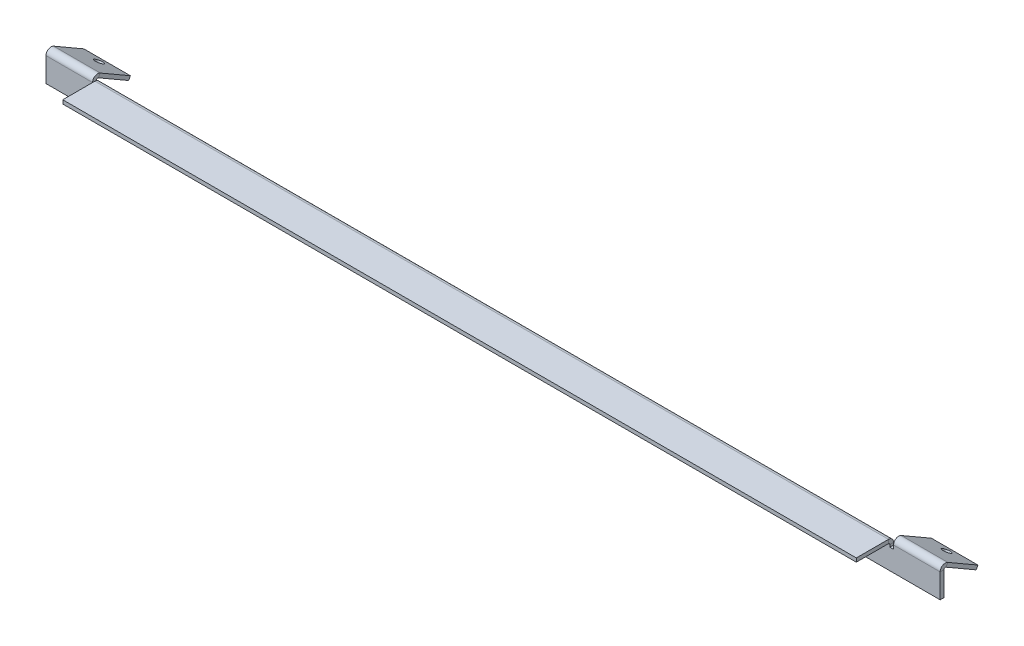
ISO-10303-21;
HEADER;
FILE_DESCRIPTION(('STEP AP214'),'2;1');
FILE_NAME('part.step','',(''),(''),'','','');
FILE_SCHEMA(('AUTOMOTIVE_DESIGN { 1 0 10303 214 1 1 1 1 }'));
ENDSEC;
DATA;
#1=APPLICATION_CONTEXT('core data for automotive mechanical design processes');
#2=APPLICATION_PROTOCOL_DEFINITION('international standard','automotive_design',2000,#1);
#3=PRODUCT_CONTEXT('',#1,'mechanical');
#4=PRODUCT('Part','Part','',(#3));
#5=PRODUCT_RELATED_PRODUCT_CATEGORY('part','',(#4));
#6=PRODUCT_DEFINITION_FORMATION('','',#4);
#7=PRODUCT_DEFINITION_CONTEXT('part definition',#1,'design');
#8=PRODUCT_DEFINITION('design','',#6,#7);
#9=PRODUCT_DEFINITION_SHAPE('','',#8);
#10=(LENGTH_UNIT() NAMED_UNIT(*) SI_UNIT(.MILLI.,.METRE.));
#11=(NAMED_UNIT(*) PLANE_ANGLE_UNIT() SI_UNIT($,.RADIAN.));
#12=(NAMED_UNIT(*) SI_UNIT($,.STERADIAN.) SOLID_ANGLE_UNIT());
#13=UNCERTAINTY_MEASURE_WITH_UNIT(LENGTH_MEASURE(1.E-05),#10,'distance_accuracy_value','');
#14=(GEOMETRIC_REPRESENTATION_CONTEXT(3) GLOBAL_UNCERTAINTY_ASSIGNED_CONTEXT((#13)) GLOBAL_UNIT_ASSIGNED_CONTEXT((#10,
#11,#12)) REPRESENTATION_CONTEXT('',''));
#15=CARTESIAN_POINT('',(0.,0.,0.));
#16=DIRECTION('',(0.,0.,1.));
#17=DIRECTION('',(1.,0.,0.));
#18=AXIS2_PLACEMENT_3D('',#15,#16,#17);
#19=CARTESIAN_POINT('',(-213.,11.,-2.));
#20=DIRECTION('',(-1.,0.,0.));
#21=DIRECTION('',(0.,0.,1.));
#22=AXIS2_PLACEMENT_3D('',#19,#20,#21);
#23=PLANE('',#22);
#24=DIRECTION('',(0.,-1.,0.));
#25=VECTOR('',#24,1.);
#26=CARTESIAN_POINT('',(-213.,11.,0.));
#27=LINE('',#26,#25);
#28=CARTESIAN_POINT('',(-213.,12.2634,0.));
#29=VERTEX_POINT('',#28);
#30=CARTESIAN_POINT('',(-213.,11.,0.));
#31=VERTEX_POINT('',#30);
#32=EDGE_CURVE('E214',#29,#31,#27,.T.);
#33=ORIENTED_EDGE('',*,*,#32,.F.);
#34=DIRECTION('',(0.,0.,-1.));
#35=VECTOR('',#34,1.);
#36=CARTESIAN_POINT('',(-213.,12.2634,0.));
#37=LINE('',#36,#35);
#38=CARTESIAN_POINT('',(-213.,12.2634,-2.00000000000001));
#39=VERTEX_POINT('',#38);
#40=EDGE_CURVE('E334',#29,#39,#37,.T.);
#41=ORIENTED_EDGE('',*,*,#40,.T.);
#42=DIRECTION('',(0.,-1.,0.));
#43=VECTOR('',#42,1.);
#44=CARTESIAN_POINT('',(-213.,11.,-2.));
#45=LINE('',#44,#43);
#46=CARTESIAN_POINT('',(-213.,11.,-2.));
#47=VERTEX_POINT('',#46);
#48=EDGE_CURVE('E177',#39,#47,#45,.T.);
#49=ORIENTED_EDGE('',*,*,#48,.T.);
#50=DIRECTION('',(0.,0.,1.));
#51=VECTOR('',#50,1.);
#52=CARTESIAN_POINT('',(-213.,11.,-2.));
#53=LINE('',#52,#51);
#54=EDGE_CURVE('E164',#47,#31,#53,.T.);
#55=ORIENTED_EDGE('',*,*,#54,.T.);
#56=EDGE_LOOP('',(#33,#41,#49,#55));
#57=FACE_BOUND('',#56,.T.);
#58=ADVANCED_FACE('F75',(#57),#23,.T.);
#59=CARTESIAN_POINT('',(-240.,0.,-2.));
#60=DIRECTION('',(0.,0.,1.));
#61=DIRECTION('',(1.,0.,0.));
#62=AXIS2_PLACEMENT_3D('',#59,#60,#61);
#63=PLANE('',#62);
#64=DIRECTION('',(-1.,0.,0.));
#65=VECTOR('',#64,1.);
#66=CARTESIAN_POINT('',(-213.,12.2634,-2.00000000000001));
#67=LINE('',#66,#65);
#68=CARTESIAN_POINT('',(213.,12.2634,-2.));
#69=VERTEX_POINT('',#68);
#70=EDGE_CURVE('E176',#39,#69,#67,.F.);
#71=ORIENTED_EDGE('',*,*,#70,.T.);
#72=DIRECTION('',(0.,1.,0.));
#73=VECTOR('',#72,1.);
#74=CARTESIAN_POINT('',(213.,11.,-2.));
#75=LINE('',#74,#73);
#76=CARTESIAN_POINT('',(213.,11.,-2.));
#77=VERTEX_POINT('',#76);
#78=EDGE_CURVE('E157',#77,#69,#75,.T.);
#79=ORIENTED_EDGE('',*,*,#78,.F.);
#80=DIRECTION('',(-1.,0.,0.));
#81=VECTOR('',#80,1.);
#82=CARTESIAN_POINT('',(215.,11.,-2.));
#83=LINE('',#82,#81);
#84=CARTESIAN_POINT('',(215.,11.,-2.));
#85=VERTEX_POINT('',#84);
#86=EDGE_CURVE('E172',#85,#77,#83,.T.);
#87=ORIENTED_EDGE('',*,*,#86,.F.);
#88=DIRECTION('',(0.,-1.,0.));
#89=VECTOR('',#88,1.);
#90=CARTESIAN_POINT('',(215.,13.,-2.));
#91=LINE('',#90,#89);
#92=CARTESIAN_POINT('',(215.,13.,-2.00000000000001));
#93=VERTEX_POINT('',#92);
#94=EDGE_CURVE('E180',#93,#85,#91,.T.);
#95=ORIENTED_EDGE('',*,*,#94,.F.);
#96=DIRECTION('',(-1.,0.,0.));
#97=VECTOR('',#96,1.);
#98=CARTESIAN_POINT('',(240.,13.,-2.));
#99=LINE('',#98,#97);
#100=CARTESIAN_POINT('',(240.,13.,-2.));
#101=VERTEX_POINT('',#100);
#102=EDGE_CURVE('E182',#101,#93,#99,.T.);
#103=ORIENTED_EDGE('',*,*,#102,.F.);
#104=DIRECTION('',(0.,1.,0.));
#105=VECTOR('',#104,1.);
#106=CARTESIAN_POINT('',(240.,0.,-2.));
#107=LINE('',#106,#105);
#108=CARTESIAN_POINT('',(240.,0.,-2.));
#109=VERTEX_POINT('',#108);
#110=EDGE_CURVE('E349',#109,#101,#107,.T.);
#111=ORIENTED_EDGE('',*,*,#110,.F.);
#112=DIRECTION('',(1.,0.,0.));
#113=VECTOR('',#112,1.);
#114=CARTESIAN_POINT('',(-240.,0.,-2.));
#115=LINE('',#114,#113);
#116=CARTESIAN_POINT('',(-240.,0.,-2.));
#117=VERTEX_POINT('',#116);
#118=EDGE_CURVE('E347',#117,#109,#115,.T.);
#119=ORIENTED_EDGE('',*,*,#118,.F.);
#120=DIRECTION('',(0.,-1.,0.));
#121=VECTOR('',#120,1.);
#122=CARTESIAN_POINT('',(-240.,13.0000000000001,-2.));
#123=LINE('',#122,#121);
#124=CARTESIAN_POINT('',(-240.,13.0000000000001,-2.));
#125=VERTEX_POINT('',#124);
#126=EDGE_CURVE('E224',#125,#117,#123,.T.);
#127=ORIENTED_EDGE('',*,*,#126,.F.);
#128=DIRECTION('',(-1.,0.,0.));
#129=VECTOR('',#128,1.);
#130=CARTESIAN_POINT('',(-215.,13.0000000000001,-2.));
#131=LINE('',#130,#129);
#132=CARTESIAN_POINT('',(-215.,13.0000000000001,-2.));
#133=VERTEX_POINT('',#132);
#134=EDGE_CURVE('E192',#133,#125,#131,.T.);
#135=ORIENTED_EDGE('',*,*,#134,.F.);
#136=DIRECTION('',(0.,1.,0.));
#137=VECTOR('',#136,1.);
#138=CARTESIAN_POINT('',(-215.,13.0000000000001,-2.));
#139=LINE('',#138,#137);
#140=CARTESIAN_POINT('',(-215.,11.,-2.));
#141=VERTEX_POINT('',#140);
#142=EDGE_CURVE('E190',#141,#133,#139,.T.);
#143=ORIENTED_EDGE('',*,*,#142,.F.);
#144=DIRECTION('',(-1.,0.,0.));
#145=VECTOR('',#144,1.);
#146=CARTESIAN_POINT('',(-215.,11.,-2.));
#147=LINE('',#146,#145);
#148=EDGE_CURVE('E187',#47,#141,#147,.T.);
#149=ORIENTED_EDGE('',*,*,#148,.F.);
#150=ORIENTED_EDGE('',*,*,#48,.F.);
#151=EDGE_LOOP('',(#71,#79,#87,#95,#103,#111,#119,#127,#135,#143,#149,#150));
#152=FACE_BOUND('',#151,.T.);
#153=ADVANCED_FACE('F170',(#152),#63,.F.);
#154=CARTESIAN_POINT('',(-240.,0.,0.));
#155=DIRECTION('',(0.,0.,1.));
#156=DIRECTION('',(1.,0.,0.));
#157=AXIS2_PLACEMENT_3D('',#154,#155,#156);
#158=PLANE('',#157);
#159=DIRECTION('',(0.,1.,0.));
#160=VECTOR('',#159,1.);
#161=CARTESIAN_POINT('',(213.,11.,0.));
#162=LINE('',#161,#160);
#163=CARTESIAN_POINT('',(213.,11.,0.));
#164=VERTEX_POINT('',#163);
#165=CARTESIAN_POINT('',(213.,12.2634,0.));
#166=VERTEX_POINT('',#165);
#167=EDGE_CURVE('E159',#164,#166,#162,.T.);
#168=ORIENTED_EDGE('',*,*,#167,.T.);
#169=DIRECTION('',(-1.,0.,0.));
#170=VECTOR('',#169,1.);
#171=CARTESIAN_POINT('',(-213.,12.2634,0.));
#172=LINE('',#171,#170);
#173=EDGE_CURVE('E92',#29,#166,#172,.F.);
#174=ORIENTED_EDGE('',*,*,#173,.F.);
#175=ORIENTED_EDGE('',*,*,#32,.T.);
#176=DIRECTION('',(-1.,0.,0.));
#177=VECTOR('',#176,1.);
#178=CARTESIAN_POINT('',(-215.,11.,0.));
#179=LINE('',#178,#177);
#180=CARTESIAN_POINT('',(-215.,11.,0.));
#181=VERTEX_POINT('',#180);
#182=EDGE_CURVE('E216',#31,#181,#179,.T.);
#183=ORIENTED_EDGE('',*,*,#182,.T.);
#184=DIRECTION('',(0.,1.,0.));
#185=VECTOR('',#184,1.);
#186=CARTESIAN_POINT('',(-215.,13.0000000000001,0.));
#187=LINE('',#186,#185);
#188=CARTESIAN_POINT('',(-215.,13.0000000000001,0.));
#189=VERTEX_POINT('',#188);
#190=EDGE_CURVE('E219',#181,#189,#187,.T.);
#191=ORIENTED_EDGE('',*,*,#190,.T.);
#192=DIRECTION('',(-1.,0.,0.));
#193=VECTOR('',#192,1.);
#194=CARTESIAN_POINT('',(-215.,13.0000000000001,0.));
#195=LINE('',#194,#193);
#196=CARTESIAN_POINT('',(-240.,13.0000000000001,0.));
#197=VERTEX_POINT('',#196);
#198=EDGE_CURVE('E222',#189,#197,#195,.T.);
#199=ORIENTED_EDGE('',*,*,#198,.T.);
#200=DIRECTION('',(0.,-1.,0.));
#201=VECTOR('',#200,1.);
#202=CARTESIAN_POINT('',(-240.,13.0000000000001,0.));
#203=LINE('',#202,#201);
#204=CARTESIAN_POINT('',(-240.,0.,0.));
#205=VERTEX_POINT('',#204);
#206=EDGE_CURVE('E195',#197,#205,#203,.T.);
#207=ORIENTED_EDGE('',*,*,#206,.T.);
#208=DIRECTION('',(1.,0.,0.));
#209=VECTOR('',#208,1.);
#210=CARTESIAN_POINT('',(-240.,0.,0.));
#211=LINE('',#210,#209);
#212=CARTESIAN_POINT('',(240.,0.,0.));
#213=VERTEX_POINT('',#212);
#214=EDGE_CURVE('E198',#205,#213,#211,.T.);
#215=ORIENTED_EDGE('',*,*,#214,.T.);
#216=DIRECTION('',(0.,1.,0.));
#217=VECTOR('',#216,1.);
#218=CARTESIAN_POINT('',(240.,0.,0.));
#219=LINE('',#218,#217);
#220=CARTESIAN_POINT('',(240.,13.,0.));
#221=VERTEX_POINT('',#220);
#222=EDGE_CURVE('E202',#213,#221,#219,.T.);
#223=ORIENTED_EDGE('',*,*,#222,.T.);
#224=DIRECTION('',(-1.,0.,0.));
#225=VECTOR('',#224,1.);
#226=CARTESIAN_POINT('',(240.,13.,0.));
#227=LINE('',#226,#225);
#228=CARTESIAN_POINT('',(215.,13.,0.));
#229=VERTEX_POINT('',#228);
#230=EDGE_CURVE('E205',#221,#229,#227,.T.);
#231=ORIENTED_EDGE('',*,*,#230,.T.);
#232=DIRECTION('',(0.,-1.,0.));
#233=VECTOR('',#232,1.);
#234=CARTESIAN_POINT('',(215.,13.,0.));
#235=LINE('',#234,#233);
#236=CARTESIAN_POINT('',(215.,11.,0.));
#237=VERTEX_POINT('',#236);
#238=EDGE_CURVE('E208',#229,#237,#235,.T.);
#239=ORIENTED_EDGE('',*,*,#238,.T.);
#240=DIRECTION('',(-1.,0.,0.));
#241=VECTOR('',#240,1.);
#242=CARTESIAN_POINT('',(215.,11.,0.));
#243=LINE('',#242,#241);
#244=EDGE_CURVE('E211',#237,#164,#243,.T.);
#245=ORIENTED_EDGE('',*,*,#244,.T.);
#246=EDGE_LOOP('',(#168,#174,#175,#183,#191,#199,#207,#215,#223,#231,#239,#245));
#247=FACE_BOUND('',#246,.T.);
#248=ADVANCED_FACE('F245',(#247),#158,.T.);
#249=CARTESIAN_POINT('',(-240.,13.0000000000001,-2.));
#250=DIRECTION('',(-1.,0.,0.));
#251=DIRECTION('',(0.,-1.,0.));
#252=AXIS2_PLACEMENT_3D('',#249,#250,#251);
#253=PLANE('',#252);
#254=ORIENTED_EDGE('',*,*,#206,.F.);
#255=DIRECTION('',(0.,0.,1.));
#256=VECTOR('',#255,1.);
#257=CARTESIAN_POINT('',(-240.,13.0000000000001,-2.));
#258=LINE('',#257,#256);
#259=EDGE_CURVE('E13',#125,#197,#258,.T.);
#260=ORIENTED_EDGE('',*,*,#259,.F.);
#261=ORIENTED_EDGE('',*,*,#126,.T.);
#262=DIRECTION('',(0.,0.,1.));
#263=VECTOR('',#262,1.);
#264=CARTESIAN_POINT('',(-240.,0.,-2.));
#265=LINE('',#264,#263);
#266=EDGE_CURVE('E79',#117,#205,#265,.T.);
#267=ORIENTED_EDGE('',*,*,#266,.T.);
#268=EDGE_LOOP('',(#254,#260,#261,#267));
#269=FACE_BOUND('',#268,.T.);
#270=ADVANCED_FACE('F77',(#269),#253,.T.);
#271=CARTESIAN_POINT('',(-215.,13.0000000000001,-2.));
#272=DIRECTION('',(1.,0.,0.));
#273=DIRECTION('',(0.,1.,0.));
#274=AXIS2_PLACEMENT_3D('',#271,#272,#273);
#275=PLANE('',#274);
#276=ORIENTED_EDGE('',*,*,#190,.F.);
#277=DIRECTION('',(0.,0.,1.));
#278=VECTOR('',#277,1.);
#279=CARTESIAN_POINT('',(-215.,11.,-2.));
#280=LINE('',#279,#278);
#281=EDGE_CURVE('E101',#141,#181,#280,.T.);
#282=ORIENTED_EDGE('',*,*,#281,.F.);
#283=ORIENTED_EDGE('',*,*,#142,.T.);
#284=DIRECTION('',(0.,0.,1.));
#285=VECTOR('',#284,1.);
#286=CARTESIAN_POINT('',(-215.,13.0000000000001,-2.));
#287=LINE('',#286,#285);
#288=EDGE_CURVE('E84',#133,#189,#287,.T.);
#289=ORIENTED_EDGE('',*,*,#288,.T.);
#290=EDGE_LOOP('',(#276,#282,#283,#289));
#291=FACE_BOUND('',#290,.T.);
#292=ADVANCED_FACE('F267',(#291),#275,.T.);
#293=CARTESIAN_POINT('',(-215.,11.,-2.));
#294=DIRECTION('',(0.,1.,0.));
#295=DIRECTION('',(-1.,0.,0.));
#296=AXIS2_PLACEMENT_3D('',#293,#294,#295);
#297=PLANE('',#296);
#298=ORIENTED_EDGE('',*,*,#182,.F.);
#299=ORIENTED_EDGE('',*,*,#54,.F.);
#300=ORIENTED_EDGE('',*,*,#148,.T.);
#301=ORIENTED_EDGE('',*,*,#281,.T.);
#302=EDGE_LOOP('',(#298,#299,#300,#301));
#303=FACE_BOUND('',#302,.T.);
#304=ADVANCED_FACE('F492',(#303),#297,.T.);
#305=CARTESIAN_POINT('',(213.,11.,-2.));
#306=DIRECTION('',(1.,0.,0.));
#307=DIRECTION('',(0.,0.,-1.));
#308=AXIS2_PLACEMENT_3D('',#305,#306,#307);
#309=PLANE('',#308);
#310=DIRECTION('',(0.,0.,-1.));
#311=VECTOR('',#310,1.);
#312=CARTESIAN_POINT('',(213.,12.2634,0.));
#313=LINE('',#312,#311);
#314=EDGE_CURVE('E199',#166,#69,#313,.T.);
#315=ORIENTED_EDGE('',*,*,#314,.F.);
#316=ORIENTED_EDGE('',*,*,#167,.F.);
#317=DIRECTION('',(0.,0.,1.));
#318=VECTOR('',#317,1.);
#319=CARTESIAN_POINT('',(213.,11.,-2.));
#320=LINE('',#319,#318);
#321=EDGE_CURVE('E153',#77,#164,#320,.T.);
#322=ORIENTED_EDGE('',*,*,#321,.F.);
#323=ORIENTED_EDGE('',*,*,#78,.T.);
#324=EDGE_LOOP('',(#315,#316,#322,#323));
#325=FACE_BOUND('',#324,.T.);
#326=ADVANCED_FACE('F156',(#325),#309,.T.);
#327=CARTESIAN_POINT('',(215.,11.,-2.));
#328=DIRECTION('',(0.,1.,0.));
#329=DIRECTION('',(-1.,0.,0.));
#330=AXIS2_PLACEMENT_3D('',#327,#328,#329);
#331=PLANE('',#330);
#332=ORIENTED_EDGE('',*,*,#244,.F.);
#333=DIRECTION('',(0.,0.,1.));
#334=VECTOR('',#333,1.);
#335=CARTESIAN_POINT('',(215.,11.,-2.));
#336=LINE('',#335,#334);
#337=EDGE_CURVE('E165',#85,#237,#336,.T.);
#338=ORIENTED_EDGE('',*,*,#337,.F.);
#339=ORIENTED_EDGE('',*,*,#86,.T.);
#340=ORIENTED_EDGE('',*,*,#321,.T.);
#341=EDGE_LOOP('',(#332,#338,#339,#340));
#342=FACE_BOUND('',#341,.T.);
#343=ADVANCED_FACE('F179',(#342),#331,.T.);
#344=CARTESIAN_POINT('',(215.,13.,-2.));
#345=DIRECTION('',(-1.,0.,0.));
#346=DIRECTION('',(0.,0.,1.));
#347=AXIS2_PLACEMENT_3D('',#344,#345,#346);
#348=PLANE('',#347);
#349=ORIENTED_EDGE('',*,*,#238,.F.);
#350=DIRECTION('',(0.,0.,1.));
#351=VECTOR('',#350,1.);
#352=CARTESIAN_POINT('',(215.,13.,-2.));
#353=LINE('',#352,#351);
#354=EDGE_CURVE('E232',#93,#229,#353,.T.);
#355=ORIENTED_EDGE('',*,*,#354,.F.);
#356=ORIENTED_EDGE('',*,*,#94,.T.);
#357=ORIENTED_EDGE('',*,*,#337,.T.);
#358=EDGE_LOOP('',(#349,#355,#356,#357));
#359=FACE_BOUND('',#358,.T.);
#360=ADVANCED_FACE('F380',(#359),#348,.T.);
#361=CARTESIAN_POINT('',(240.,0.,-2.));
#362=DIRECTION('',(1.,0.,0.));
#363=DIRECTION('',(0.,0.,-1.));
#364=AXIS2_PLACEMENT_3D('',#361,#362,#363);
#365=PLANE('',#364);
#366=ORIENTED_EDGE('',*,*,#222,.F.);
#367=DIRECTION('',(0.,0.,1.));
#368=VECTOR('',#367,1.);
#369=CARTESIAN_POINT('',(240.,0.,-2.));
#370=LINE('',#369,#368);
#371=EDGE_CURVE('E237',#109,#213,#370,.T.);
#372=ORIENTED_EDGE('',*,*,#371,.F.);
#373=ORIENTED_EDGE('',*,*,#110,.T.);
#374=DIRECTION('',(0.,0.,1.));
#375=VECTOR('',#374,1.);
#376=CARTESIAN_POINT('',(240.,13.,-2.));
#377=LINE('',#376,#375);
#378=EDGE_CURVE('E235',#101,#221,#377,.T.);
#379=ORIENTED_EDGE('',*,*,#378,.T.);
#380=EDGE_LOOP('',(#366,#372,#373,#379));
#381=FACE_BOUND('',#380,.T.);
#382=ADVANCED_FACE('F400',(#381),#365,.T.);
#383=CARTESIAN_POINT('',(-240.,0.,-2.));
#384=DIRECTION('',(0.,-1.,0.));
#385=DIRECTION('',(1.,0.,0.));
#386=AXIS2_PLACEMENT_3D('',#383,#384,#385);
#387=PLANE('',#386);
#388=ORIENTED_EDGE('',*,*,#214,.F.);
#389=ORIENTED_EDGE('',*,*,#266,.F.);
#390=ORIENTED_EDGE('',*,*,#118,.T.);
#391=ORIENTED_EDGE('',*,*,#371,.T.);
#392=EDGE_LOOP('',(#388,#389,#390,#391));
#393=FACE_BOUND('',#392,.T.);
#394=ADVANCED_FACE('F244',(#393),#387,.T.);
#395=CARTESIAN_POINT('',(213.,12.2634,0.736599999999997));
#396=DIRECTION('',(1.,0.,0.));
#397=DIRECTION('',(0.,0.,-1.));
#398=AXIS2_PLACEMENT_3D('',#395,#396,#397);
#399=PLANE('',#398);
#400=DIRECTION('',(0.,1.,0.));
#401=VECTOR('',#400,1.);
#402=CARTESIAN_POINT('',(213.,13.,0.736599999999997));
#403=LINE('',#402,#401);
#404=CARTESIAN_POINT('',(213.,13.,0.736599999999994));
#405=VERTEX_POINT('',#404);
#406=CARTESIAN_POINT('',(213.,15.,0.736599999999987));
#407=VERTEX_POINT('',#406);
#408=EDGE_CURVE('E296',#405,#407,#403,.T.);
#409=ORIENTED_EDGE('',*,*,#408,.F.);
#410=CARTESIAN_POINT('',(213.,12.2634,0.736599999999997));
#411=DIRECTION('',(-1.,0.,0.));
#412=DIRECTION('',(0.,0.,1.));
#413=AXIS2_PLACEMENT_3D('',#410,#411,#412);
#414=CIRCLE('',#413,0.736600000000004);
#415=EDGE_CURVE('E337',#166,#405,#414,.F.);
#416=ORIENTED_EDGE('',*,*,#415,.F.);
#417=ORIENTED_EDGE('',*,*,#314,.T.);
#418=CARTESIAN_POINT('',(213.,12.2634,0.736599999999997));
#419=DIRECTION('',(-1.,0.,0.));
#420=DIRECTION('',(0.,0.,1.));
#421=AXIS2_PLACEMENT_3D('',#418,#419,#420);
#422=CIRCLE('',#421,2.7366);
#423=EDGE_CURVE('E330',#69,#407,#422,.F.);
#424=ORIENTED_EDGE('',*,*,#423,.T.);
#425=EDGE_LOOP('',(#409,#416,#417,#424));
#426=FACE_BOUND('',#425,.T.);
#427=ADVANCED_FACE('F448',(#426),#399,.T.);
#428=CARTESIAN_POINT('',(-213.,12.2634,0.736599999999997));
#429=DIRECTION('',(1.,0.,0.));
#430=DIRECTION('',(0.,0.,-1.));
#431=AXIS2_PLACEMENT_3D('',#428,#429,#430);
#432=PLANE('',#431);
#433=CARTESIAN_POINT('',(-213.,12.2634,0.736599999999997));
#434=DIRECTION('',(-1.,0.,0.));
#435=DIRECTION('',(0.,0.,1.));
#436=AXIS2_PLACEMENT_3D('',#433,#434,#435);
#437=CIRCLE('',#436,0.736600000000004);
#438=CARTESIAN_POINT('',(-213.,13.,0.736599999999994));
#439=VERTEX_POINT('',#438);
#440=EDGE_CURVE('E328',#439,#29,#437,.T.);
#441=ORIENTED_EDGE('',*,*,#440,.F.);
#442=DIRECTION('',(0.,1.,0.));
#443=VECTOR('',#442,1.);
#444=CARTESIAN_POINT('',(-213.,13.,0.736599999999992));
#445=LINE('',#444,#443);
#446=CARTESIAN_POINT('',(-213.,15.,0.736599999999985));
#447=VERTEX_POINT('',#446);
#448=EDGE_CURVE('E295',#439,#447,#445,.T.);
#449=ORIENTED_EDGE('',*,*,#448,.T.);
#450=CARTESIAN_POINT('',(-213.,12.2634,0.736599999999997));
#451=DIRECTION('',(-1.,0.,0.));
#452=DIRECTION('',(0.,0.,1.));
#453=AXIS2_PLACEMENT_3D('',#450,#451,#452);
#454=CIRCLE('',#453,2.7366);
#455=EDGE_CURVE('E331',#447,#39,#454,.T.);
#456=ORIENTED_EDGE('',*,*,#455,.T.);
#457=ORIENTED_EDGE('',*,*,#40,.F.);
#458=EDGE_LOOP('',(#441,#449,#456,#457));
#459=FACE_BOUND('',#458,.T.);
#460=ADVANCED_FACE('F469',(#459),#432,.F.);
#461=CARTESIAN_POINT('',(-213.,12.2634,0.736599999999997));
#462=DIRECTION('',(-1.,0.,0.));
#463=DIRECTION('',(0.,1.,0.));
#464=AXIS2_PLACEMENT_3D('',#461,#462,#463);
#465=CYLINDRICAL_SURFACE('',#464,2.7366);
#466=ORIENTED_EDGE('',*,*,#70,.F.);
#467=ORIENTED_EDGE('',*,*,#455,.F.);
#468=DIRECTION('',(1.,0.,0.));
#469=VECTOR('',#468,1.);
#470=CARTESIAN_POINT('',(-213.,15.,0.736599999999985));
#471=LINE('',#470,#469);
#472=EDGE_CURVE('E299',#447,#407,#471,.T.);
#473=ORIENTED_EDGE('',*,*,#472,.T.);
#474=ORIENTED_EDGE('',*,*,#423,.F.);
#475=EDGE_LOOP('',(#466,#467,#473,#474));
#476=FACE_BOUND('',#475,.T.);
#477=ADVANCED_FACE('F479',(#476),#465,.T.);
#478=CARTESIAN_POINT('',(-213.,12.2634,0.736599999999997));
#479=DIRECTION('',(-1.,0.,0.));
#480=DIRECTION('',(0.,1.,0.));
#481=AXIS2_PLACEMENT_3D('',#478,#479,#480);
#482=CYLINDRICAL_SURFACE('',#481,0.736600000000004);
#483=ORIENTED_EDGE('',*,*,#173,.T.);
#484=ORIENTED_EDGE('',*,*,#415,.T.);
#485=DIRECTION('',(-1.,0.,0.));
#486=VECTOR('',#485,1.);
#487=CARTESIAN_POINT('',(213.,13.,0.736599999999997));
#488=LINE('',#487,#486);
#489=EDGE_CURVE('E292',#405,#439,#488,.T.);
#490=ORIENTED_EDGE('',*,*,#489,.T.);
#491=ORIENTED_EDGE('',*,*,#440,.T.);
#492=EDGE_LOOP('',(#483,#484,#490,#491));
#493=FACE_BOUND('',#492,.T.);
#494=ADVANCED_FACE('F445',(#493),#482,.F.);
#495=CARTESIAN_POINT('',(-213.,15.0000000000001,18.));
#496=DIRECTION('',(1.,0.,0.));
#497=DIRECTION('',(0.,1.,0.));
#498=AXIS2_PLACEMENT_3D('',#495,#496,#497);
#499=PLANE('',#498);
#500=ORIENTED_EDGE('',*,*,#448,.F.);
#501=DIRECTION('',(0.,0.,1.));
#502=VECTOR('',#501,1.);
#503=CARTESIAN_POINT('',(-213.,13.0000000000001,18.));
#504=LINE('',#503,#502);
#505=CARTESIAN_POINT('',(-213.,13.0000000000001,18.));
#506=VERTEX_POINT('',#505);
#507=EDGE_CURVE('E304',#439,#506,#504,.T.);
#508=ORIENTED_EDGE('',*,*,#507,.T.);
#509=DIRECTION('',(0.,-1.,0.));
#510=VECTOR('',#509,1.);
#511=CARTESIAN_POINT('',(-213.,15.0000000000001,18.));
#512=LINE('',#511,#510);
#513=CARTESIAN_POINT('',(-213.,15.0000000000001,18.));
#514=VERTEX_POINT('',#513);
#515=EDGE_CURVE('E325',#514,#506,#512,.T.);
#516=ORIENTED_EDGE('',*,*,#515,.F.);
#517=DIRECTION('',(0.,0.,1.));
#518=VECTOR('',#517,1.);
#519=CARTESIAN_POINT('',(-213.,15.0000000000001,18.));
#520=LINE('',#519,#518);
#521=EDGE_CURVE('E305',#447,#514,#520,.T.);
#522=ORIENTED_EDGE('',*,*,#521,.F.);
#523=EDGE_LOOP('',(#500,#508,#516,#522));
#524=FACE_BOUND('',#523,.T.);
#525=ADVANCED_FACE('F471',(#524),#499,.F.);
#526=CARTESIAN_POINT('',(213.,15.,0.));
#527=DIRECTION('',(-1.,0.,0.));
#528=DIRECTION('',(0.,-1.,0.));
#529=AXIS2_PLACEMENT_3D('',#526,#527,#528);
#530=PLANE('',#529);
#531=ORIENTED_EDGE('',*,*,#408,.T.);
#532=DIRECTION('',(0.,0.,-1.));
#533=VECTOR('',#532,1.);
#534=CARTESIAN_POINT('',(213.,15.,0.));
#535=LINE('',#534,#533);
#536=CARTESIAN_POINT('',(213.,15.0000000000001,18.));
#537=VERTEX_POINT('',#536);
#538=EDGE_CURVE('E312',#537,#407,#535,.T.);
#539=ORIENTED_EDGE('',*,*,#538,.F.);
#540=DIRECTION('',(0.,-1.,0.));
#541=VECTOR('',#540,1.);
#542=CARTESIAN_POINT('',(213.,15.0000000000001,18.));
#543=LINE('',#542,#541);
#544=CARTESIAN_POINT('',(213.,13.0000000000001,18.));
#545=VERTEX_POINT('',#544);
#546=EDGE_CURVE('E315',#537,#545,#543,.T.);
#547=ORIENTED_EDGE('',*,*,#546,.T.);
#548=DIRECTION('',(0.,0.,-1.));
#549=VECTOR('',#548,1.);
#550=CARTESIAN_POINT('',(213.,13.,0.));
#551=LINE('',#550,#549);
#552=EDGE_CURVE('E309',#545,#405,#551,.T.);
#553=ORIENTED_EDGE('',*,*,#552,.T.);
#554=EDGE_LOOP('',(#531,#539,#547,#553));
#555=FACE_BOUND('',#554,.T.);
#556=ADVANCED_FACE('F451',(#555),#530,.F.);
#557=CARTESIAN_POINT('',(-213.,15.,0.));
#558=DIRECTION('',(0.,-1.,0.));
#559=DIRECTION('',(0.,0.,-1.));
#560=AXIS2_PLACEMENT_3D('',#557,#558,#559);
#561=PLANE('',#560);
#562=ORIENTED_EDGE('',*,*,#472,.F.);
#563=ORIENTED_EDGE('',*,*,#521,.T.);
#564=DIRECTION('',(1.,0.,0.));
#565=VECTOR('',#564,1.);
#566=CARTESIAN_POINT('',(213.,15.0000000000001,18.));
#567=LINE('',#566,#565);
#568=EDGE_CURVE('E308',#514,#537,#567,.T.);
#569=ORIENTED_EDGE('',*,*,#568,.T.);
#570=ORIENTED_EDGE('',*,*,#538,.T.);
#571=EDGE_LOOP('',(#562,#563,#569,#570));
#572=FACE_BOUND('',#571,.T.);
#573=ADVANCED_FACE('F455',(#572),#561,.F.);
#574=CARTESIAN_POINT('',(-213.,13.,0.));
#575=DIRECTION('',(0.,-1.,0.));
#576=DIRECTION('',(0.,0.,-1.));
#577=AXIS2_PLACEMENT_3D('',#574,#575,#576);
#578=PLANE('',#577);
#579=ORIENTED_EDGE('',*,*,#507,.F.);
#580=ORIENTED_EDGE('',*,*,#489,.F.);
#581=ORIENTED_EDGE('',*,*,#552,.F.);
#582=DIRECTION('',(1.,0.,0.));
#583=VECTOR('',#582,1.);
#584=CARTESIAN_POINT('',(213.,13.0000000000001,18.));
#585=LINE('',#584,#583);
#586=EDGE_CURVE('E318',#506,#545,#585,.T.);
#587=ORIENTED_EDGE('',*,*,#586,.F.);
#588=EDGE_LOOP('',(#579,#580,#581,#587));
#589=FACE_BOUND('',#588,.T.);
#590=ADVANCED_FACE('F465',(#589),#578,.T.);
#591=CARTESIAN_POINT('',(213.,15.0000000000001,18.));
#592=DIRECTION('',(0.,0.,-1.));
#593=DIRECTION('',(0.,1.,0.));
#594=AXIS2_PLACEMENT_3D('',#591,#592,#593);
#595=PLANE('',#594);
#596=ORIENTED_EDGE('',*,*,#586,.T.);
#597=ORIENTED_EDGE('',*,*,#546,.F.);
#598=ORIENTED_EDGE('',*,*,#568,.F.);
#599=ORIENTED_EDGE('',*,*,#515,.T.);
#600=EDGE_LOOP('',(#596,#597,#598,#599));
#601=FACE_BOUND('',#600,.T.);
#602=ADVANCED_FACE('F461',(#601),#595,.F.);
#603=CARTESIAN_POINT('',(-240.,13.0000000000001,-2.7366));
#604=DIRECTION('',(-1.,0.,0.));
#605=DIRECTION('',(0.,0.,1.));
#606=AXIS2_PLACEMENT_3D('',#603,#604,#605);
#607=PLANE('',#606);
#608=DIRECTION('',(0.,-0.866025403784441,0.499999999999996));
#609=VECTOR('',#608,1.);
#610=CARTESIAN_POINT('',(-240.,15.3699651199966,-4.10489999999999));
#611=LINE('',#610,#609);
#612=CARTESIAN_POINT('',(-240.,13.6379143124277,-3.1049));
#613=VERTEX_POINT('',#612);
#614=CARTESIAN_POINT('',(-240.,15.3699651199966,-4.10489999999999));
#615=VERTEX_POINT('',#614);
#616=EDGE_CURVE('E286',#613,#615,#611,.F.);
#617=ORIENTED_EDGE('',*,*,#616,.F.);
#618=CARTESIAN_POINT('',(-240.,13.0000000000001,-2.7366));
#619=DIRECTION('',(1.,0.,0.));
#620=DIRECTION('',(0.,0.,-1.));
#621=AXIS2_PLACEMENT_3D('',#618,#619,#620);
#622=CIRCLE('',#621,0.736599999999999);
#623=EDGE_CURVE('E265',#125,#613,#622,.F.);
#624=ORIENTED_EDGE('',*,*,#623,.F.);
#625=ORIENTED_EDGE('',*,*,#259,.T.);
#626=CARTESIAN_POINT('',(-240.,13.0000000000001,-2.7366));
#627=DIRECTION('',(1.,0.,0.));
#628=DIRECTION('',(0.,0.,-1.));
#629=AXIS2_PLACEMENT_3D('',#626,#627,#628);
#630=CIRCLE('',#629,2.7366);
#631=EDGE_CURVE('E134',#197,#615,#630,.F.);
#632=ORIENTED_EDGE('',*,*,#631,.T.);
#633=EDGE_LOOP('',(#617,#624,#625,#632));
#634=FACE_BOUND('',#633,.T.);
#635=ADVANCED_FACE('F284',(#634),#607,.T.);
#636=CARTESIAN_POINT('',(-215.,13.0000000000001,-2.7366));
#637=DIRECTION('',(-1.,0.,0.));
#638=DIRECTION('',(0.,0.,1.));
#639=AXIS2_PLACEMENT_3D('',#636,#637,#638);
#640=PLANE('',#639);
#641=CARTESIAN_POINT('',(-215.,13.0000000000001,-2.7366));
#642=DIRECTION('',(1.,0.,0.));
#643=DIRECTION('',(0.,0.,-1.));
#644=AXIS2_PLACEMENT_3D('',#641,#642,#643);
#645=CIRCLE('',#644,0.736599999999999);
#646=CARTESIAN_POINT('',(-215.,13.6379143124277,-3.1049));
#647=VERTEX_POINT('',#646);
#648=EDGE_CURVE('E280',#647,#133,#645,.T.);
#649=ORIENTED_EDGE('',*,*,#648,.F.);
#650=DIRECTION('',(0.,-0.866025403784441,0.499999999999996));
#651=VECTOR('',#650,1.);
#652=CARTESIAN_POINT('',(-215.,13.6379143124277,-3.1049));
#653=LINE('',#652,#651);
#654=CARTESIAN_POINT('',(-215.,15.3699651199966,-4.10489999999999));
#655=VERTEX_POINT('',#654);
#656=EDGE_CURVE('E263',#647,#655,#653,.F.);
#657=ORIENTED_EDGE('',*,*,#656,.T.);
#658=CARTESIAN_POINT('',(-215.,13.0000000000001,-2.7366));
#659=DIRECTION('',(1.,0.,0.));
#660=DIRECTION('',(0.,0.,-1.));
#661=AXIS2_PLACEMENT_3D('',#658,#659,#660);
#662=CIRCLE('',#661,2.7366);
#663=EDGE_CURVE('E251',#655,#189,#662,.T.);
#664=ORIENTED_EDGE('',*,*,#663,.T.);
#665=ORIENTED_EDGE('',*,*,#288,.F.);
#666=EDGE_LOOP('',(#649,#657,#664,#665));
#667=FACE_BOUND('',#666,.T.);
#668=ADVANCED_FACE('F259',(#667),#640,.F.);
#669=CARTESIAN_POINT('',(-215.,13.0000000000001,-2.7366));
#670=DIRECTION('',(1.,0.,0.));
#671=DIRECTION('',(0.,0.866025403784441,-0.499999999999996));
#672=AXIS2_PLACEMENT_3D('',#669,#670,#671);
#673=CYLINDRICAL_SURFACE('',#672,2.7366);
#674=ORIENTED_EDGE('',*,*,#198,.F.);
#675=ORIENTED_EDGE('',*,*,#663,.F.);
#676=DIRECTION('',(1.,0.,0.));
#677=VECTOR('',#676,1.);
#678=CARTESIAN_POINT('',(-240.,15.3699651199966,-4.10489999999999));
#679=LINE('',#678,#677);
#680=EDGE_CURVE('E954',#655,#615,#679,.F.);
#681=ORIENTED_EDGE('',*,*,#680,.T.);
#682=ORIENTED_EDGE('',*,*,#631,.F.);
#683=EDGE_LOOP('',(#674,#675,#681,#682));
#684=FACE_BOUND('',#683,.T.);
#685=ADVANCED_FACE('F249',(#684),#673,.T.);
#686=CARTESIAN_POINT('',(-215.,13.0000000000001,-2.7366));
#687=DIRECTION('',(1.,0.,0.));
#688=DIRECTION('',(0.,0.866025403784441,-0.499999999999996));
#689=AXIS2_PLACEMENT_3D('',#686,#687,#688);
#690=CYLINDRICAL_SURFACE('',#689,0.736599999999999);
#691=ORIENTED_EDGE('',*,*,#134,.T.);
#692=ORIENTED_EDGE('',*,*,#623,.T.);
#693=DIRECTION('',(1.,0.,0.));
#694=VECTOR('',#693,1.);
#695=CARTESIAN_POINT('',(-240.,13.6379143124277,-3.1049));
#696=LINE('',#695,#694);
#697=EDGE_CURVE('E957',#613,#647,#696,.T.);
#698=ORIENTED_EDGE('',*,*,#697,.T.);
#699=ORIENTED_EDGE('',*,*,#648,.T.);
#700=EDGE_LOOP('',(#691,#692,#698,#699));
#701=FACE_BOUND('',#700,.T.);
#702=ADVANCED_FACE('F276',(#701),#690,.F.);
#703=CARTESIAN_POINT('',(-215.,6.0078794324243,-20.3205080756888));
#704=DIRECTION('',(-1.,0.,0.));
#705=DIRECTION('',(0.,0.,1.));
#706=AXIS2_PLACEMENT_3D('',#703,#704,#705);
#707=PLANE('',#706);
#708=ORIENTED_EDGE('',*,*,#656,.F.);
#709=DIRECTION('',(0.,0.499999999999996,0.866025403784441));
#710=VECTOR('',#709,1.);
#711=CARTESIAN_POINT('',(-215.,4.27582862485542,-19.3205080756888));
#712=LINE('',#711,#710);
#713=CARTESIAN_POINT('',(-215.,4.27582862485542,-19.3205080756888));
#714=VERTEX_POINT('',#713);
#715=EDGE_CURVE('E952',#647,#714,#712,.F.);
#716=ORIENTED_EDGE('',*,*,#715,.T.);
#717=DIRECTION('',(0.,-0.866025403784441,0.499999999999996));
#718=VECTOR('',#717,1.);
#719=CARTESIAN_POINT('',(-215.,6.0078794324243,-20.3205080756888));
#720=LINE('',#719,#718);
#721=CARTESIAN_POINT('',(-215.,6.0078794324243,-20.3205080756888));
#722=VERTEX_POINT('',#721);
#723=EDGE_CURVE('E288',#722,#714,#720,.T.);
#724=ORIENTED_EDGE('',*,*,#723,.F.);
#725=DIRECTION('',(0.,-0.499999999999996,-0.866025403784441));
#726=VECTOR('',#725,1.);
#727=CARTESIAN_POINT('',(-215.,16.0078794324242,-3.00000000000002));
#728=LINE('',#727,#726);
#729=EDGE_CURVE('E945',#655,#722,#728,.T.);
#730=ORIENTED_EDGE('',*,*,#729,.F.);
#731=EDGE_LOOP('',(#708,#716,#724,#730));
#732=FACE_BOUND('',#731,.T.);
#733=ADVANCED_FACE('F686',(#732),#707,.F.);
#734=CARTESIAN_POINT('',(-240.,16.0078794324242,-2.99999999999999));
#735=DIRECTION('',(1.,0.,0.));
#736=DIRECTION('',(0.,0.,-1.));
#737=AXIS2_PLACEMENT_3D('',#734,#735,#736);
#738=PLANE('',#737);
#739=ORIENTED_EDGE('',*,*,#616,.T.);
#740=DIRECTION('',(0.,0.499999999999996,0.866025403784441));
#741=VECTOR('',#740,1.);
#742=CARTESIAN_POINT('',(-240.,16.0078794324242,-2.99999999999999));
#743=LINE('',#742,#741);
#744=CARTESIAN_POINT('',(-240.,6.0078794324243,-20.3205080756888));
#745=VERTEX_POINT('',#744);
#746=EDGE_CURVE('E940',#745,#615,#743,.T.);
#747=ORIENTED_EDGE('',*,*,#746,.F.);
#748=DIRECTION('',(0.,-0.866025403784441,0.499999999999996));
#749=VECTOR('',#748,1.);
#750=CARTESIAN_POINT('',(-240.,6.0078794324243,-20.3205080756888));
#751=LINE('',#750,#749);
#752=CARTESIAN_POINT('',(-240.,4.27582862485542,-19.3205080756888));
#753=VERTEX_POINT('',#752);
#754=EDGE_CURVE('E937',#745,#753,#751,.T.);
#755=ORIENTED_EDGE('',*,*,#754,.T.);
#756=DIRECTION('',(0.,-0.499999999999996,-0.866025403784441));
#757=VECTOR('',#756,1.);
#758=CARTESIAN_POINT('',(-240.,14.2758286248553,-2.));
#759=LINE('',#758,#757);
#760=EDGE_CURVE('E947',#753,#613,#759,.F.);
#761=ORIENTED_EDGE('',*,*,#760,.T.);
#762=EDGE_LOOP('',(#739,#747,#755,#761));
#763=FACE_BOUND('',#762,.T.);
#764=ADVANCED_FACE('F696',(#763),#738,.F.);
#765=CARTESIAN_POINT('',(-240.,16.0078794324242,-2.99999999999999));
#766=DIRECTION('',(0.,-0.866025403784441,0.499999999999996));
#767=DIRECTION('',(0.,-0.499999999999996,-0.866025403784441));
#768=AXIS2_PLACEMENT_3D('',#765,#766,#767);
#769=PLANE('',#768);
#770=CARTESIAN_POINT('',(-227.5,8.50787943242421,-15.9903810567667));
#771=DIRECTION('',(0.,-0.866025403784441,0.499999999999996));
#772=DIRECTION('',(0.,-0.499999999999996,-0.866025403784441));
#773=AXIS2_PLACEMENT_3D('',#770,#771,#772);
#774=CIRCLE('',#773,2.25000000000001);
#775=CARTESIAN_POINT('',(-227.5,7.38287943242422,-17.9389382152817));
#776=VERTEX_POINT('',#775);
#777=EDGE_CURVE('E893',#776,#776,#774,.T.);
#778=ORIENTED_EDGE('',*,*,#777,.T.);
#779=EDGE_LOOP('',(#778));
#780=FACE_BOUND('',#779,.T.);
#781=ORIENTED_EDGE('',*,*,#680,.F.);
#782=ORIENTED_EDGE('',*,*,#729,.T.);
#783=DIRECTION('',(-1.,0.,0.));
#784=VECTOR('',#783,1.);
#785=CARTESIAN_POINT('',(-240.,6.0078794324243,-20.3205080756888));
#786=LINE('',#785,#784);
#787=EDGE_CURVE('E943',#722,#745,#786,.T.);
#788=ORIENTED_EDGE('',*,*,#787,.T.);
#789=ORIENTED_EDGE('',*,*,#746,.T.);
#790=EDGE_LOOP('',(#781,#782,#788,#789));
#791=FACE_BOUND('',#790,.T.);
#792=ADVANCED_FACE('F707',(#780,#791),#769,.F.);
#793=CARTESIAN_POINT('',(-240.,14.2758286248553,-2.));
#794=DIRECTION('',(0.,-0.866025403784441,0.499999999999996));
#795=DIRECTION('',(0.,-0.499999999999996,-0.866025403784441));
#796=AXIS2_PLACEMENT_3D('',#793,#794,#795);
#797=PLANE('',#796);
#798=CARTESIAN_POINT('',(-227.5,6.77582862485517,-14.9903810567666));
#799=DIRECTION('',(0.,-0.866025403784441,0.499999999999997));
#800=DIRECTION('',(0.,-0.499999999999997,-0.866025403784441));
#801=AXIS2_PLACEMENT_3D('',#798,#799,#800);
#802=CIRCLE('',#801,2.25000000000001);
#803=CARTESIAN_POINT('',(-227.5,5.65082862485518,-16.9389382152816));
#804=VERTEX_POINT('',#803);
#805=EDGE_CURVE('E890',#804,#804,#802,.T.);
#806=ORIENTED_EDGE('',*,*,#805,.F.);
#807=EDGE_LOOP('',(#806));
#808=FACE_BOUND('',#807,.T.);
#809=ORIENTED_EDGE('',*,*,#715,.F.);
#810=ORIENTED_EDGE('',*,*,#697,.F.);
#811=ORIENTED_EDGE('',*,*,#760,.F.);
#812=DIRECTION('',(1.,0.,0.));
#813=VECTOR('',#812,1.);
#814=CARTESIAN_POINT('',(-240.,4.27582862485542,-19.3205080756888));
#815=LINE('',#814,#813);
#816=EDGE_CURVE('E950',#714,#753,#815,.F.);
#817=ORIENTED_EDGE('',*,*,#816,.F.);
#818=EDGE_LOOP('',(#809,#810,#811,#817));
#819=FACE_BOUND('',#818,.T.);
#820=ADVANCED_FACE('F721',(#808,#819),#797,.T.);
#821=CARTESIAN_POINT('',(-240.,6.0078794324243,-20.3205080756888));
#822=DIRECTION('',(0.,0.499999999999996,0.866025403784441));
#823=DIRECTION('',(0.,-0.866025403784441,0.499999999999996));
#824=AXIS2_PLACEMENT_3D('',#821,#822,#823);
#825=PLANE('',#824);
#826=ORIENTED_EDGE('',*,*,#816,.T.);
#827=ORIENTED_EDGE('',*,*,#754,.F.);
#828=ORIENTED_EDGE('',*,*,#787,.F.);
#829=ORIENTED_EDGE('',*,*,#723,.T.);
#830=EDGE_LOOP('',(#826,#827,#828,#829));
#831=FACE_BOUND('',#830,.T.);
#832=ADVANCED_FACE('F716',(#831),#825,.F.);
#833=CARTESIAN_POINT('',(215.,13.,-2.7366));
#834=DIRECTION('',(-1.,0.,0.));
#835=DIRECTION('',(0.,0.,1.));
#836=AXIS2_PLACEMENT_3D('',#833,#834,#835);
#837=PLANE('',#836);
#838=DIRECTION('',(0.,-0.866025403784441,0.499999999999996));
#839=VECTOR('',#838,1.);
#840=CARTESIAN_POINT('',(215.,15.3699651199965,-4.10489999999998));
#841=LINE('',#840,#839);
#842=CARTESIAN_POINT('',(215.,13.6379143124276,-3.1049));
#843=VERTEX_POINT('',#842);
#844=CARTESIAN_POINT('',(215.,15.3699651199965,-4.10489999999999));
#845=VERTEX_POINT('',#844);
#846=EDGE_CURVE('E376',#843,#845,#841,.F.);
#847=ORIENTED_EDGE('',*,*,#846,.F.);
#848=CARTESIAN_POINT('',(215.,13.,-2.7366));
#849=DIRECTION('',(1.,0.,0.));
#850=DIRECTION('',(0.,0.,-1.));
#851=AXIS2_PLACEMENT_3D('',#848,#849,#850);
#852=CIRCLE('',#851,0.736599999999997);
#853=EDGE_CURVE('E361',#93,#843,#852,.F.);
#854=ORIENTED_EDGE('',*,*,#853,.F.);
#855=ORIENTED_EDGE('',*,*,#354,.T.);
#856=CARTESIAN_POINT('',(215.,13.,-2.7366));
#857=DIRECTION('',(1.,0.,0.));
#858=DIRECTION('',(0.,0.,-1.));
#859=AXIS2_PLACEMENT_3D('',#856,#857,#858);
#860=CIRCLE('',#859,2.7366);
#861=EDGE_CURVE('E390',#229,#845,#860,.F.);
#862=ORIENTED_EDGE('',*,*,#861,.T.);
#863=EDGE_LOOP('',(#847,#854,#855,#862));
#864=FACE_BOUND('',#863,.T.);
#865=ADVANCED_FACE('F372',(#864),#837,.T.);
#866=CARTESIAN_POINT('',(240.,13.,-2.7366));
#867=DIRECTION('',(-1.,0.,0.));
#868=DIRECTION('',(0.,0.,1.));
#869=AXIS2_PLACEMENT_3D('',#866,#867,#868);
#870=PLANE('',#869);
#871=CARTESIAN_POINT('',(240.,13.,-2.7366));
#872=DIRECTION('',(1.,0.,0.));
#873=DIRECTION('',(0.,0.,-1.));
#874=AXIS2_PLACEMENT_3D('',#871,#872,#873);
#875=CIRCLE('',#874,0.736599999999997);
#876=CARTESIAN_POINT('',(240.,13.6379143124276,-3.10489999999999));
#877=VERTEX_POINT('',#876);
#878=EDGE_CURVE('E365',#877,#101,#875,.T.);
#879=ORIENTED_EDGE('',*,*,#878,.F.);
#880=DIRECTION('',(0.,-0.866025403784441,0.499999999999996));
#881=VECTOR('',#880,1.);
#882=CARTESIAN_POINT('',(240.,13.6379143124276,-3.10489999999999));
#883=LINE('',#882,#881);
#884=CARTESIAN_POINT('',(240.,15.3699651199965,-4.10489999999999));
#885=VERTEX_POINT('',#884);
#886=EDGE_CURVE('E396',#877,#885,#883,.F.);
#887=ORIENTED_EDGE('',*,*,#886,.T.);
#888=CARTESIAN_POINT('',(240.,13.,-2.7366));
#889=DIRECTION('',(1.,0.,0.));
#890=DIRECTION('',(0.,0.,-1.));
#891=AXIS2_PLACEMENT_3D('',#888,#889,#890);
#892=CIRCLE('',#891,2.7366);
#893=EDGE_CURVE('E377',#885,#221,#892,.T.);
#894=ORIENTED_EDGE('',*,*,#893,.T.);
#895=ORIENTED_EDGE('',*,*,#378,.F.);
#896=EDGE_LOOP('',(#879,#887,#894,#895));
#897=FACE_BOUND('',#896,.T.);
#898=ADVANCED_FACE('F394',(#897),#870,.F.);
#899=CARTESIAN_POINT('',(240.,13.,-2.7366));
#900=DIRECTION('',(1.,0.,0.));
#901=DIRECTION('',(0.,0.866025403784441,-0.499999999999996));
#902=AXIS2_PLACEMENT_3D('',#899,#900,#901);
#903=CYLINDRICAL_SURFACE('',#902,2.7366);
#904=ORIENTED_EDGE('',*,*,#230,.F.);
#905=ORIENTED_EDGE('',*,*,#893,.F.);
#906=DIRECTION('',(1.,0.,0.));
#907=VECTOR('',#906,1.);
#908=CARTESIAN_POINT('',(215.,15.3699651199965,-4.10489999999999));
#909=LINE('',#908,#907);
#910=EDGE_CURVE('E927',#845,#885,#909,.T.);
#911=ORIENTED_EDGE('',*,*,#910,.F.);
#912=ORIENTED_EDGE('',*,*,#861,.F.);
#913=EDGE_LOOP('',(#904,#905,#911,#912));
#914=FACE_BOUND('',#913,.T.);
#915=ADVANCED_FACE('F386',(#914),#903,.T.);
#916=CARTESIAN_POINT('',(240.,13.,-2.7366));
#917=DIRECTION('',(1.,0.,0.));
#918=DIRECTION('',(0.,0.866025403784441,-0.499999999999996));
#919=AXIS2_PLACEMENT_3D('',#916,#917,#918);
#920=CYLINDRICAL_SURFACE('',#919,0.736599999999997);
#921=ORIENTED_EDGE('',*,*,#102,.T.);
#922=ORIENTED_EDGE('',*,*,#853,.T.);
#923=DIRECTION('',(-1.,0.,0.));
#924=VECTOR('',#923,1.);
#925=CARTESIAN_POINT('',(215.,13.6379143124276,-3.1049));
#926=LINE('',#925,#924);
#927=EDGE_CURVE('E930',#843,#877,#926,.F.);
#928=ORIENTED_EDGE('',*,*,#927,.T.);
#929=ORIENTED_EDGE('',*,*,#878,.T.);
#930=EDGE_LOOP('',(#921,#922,#928,#929));
#931=FACE_BOUND('',#930,.T.);
#932=ADVANCED_FACE('F358',(#931),#920,.F.);
#933=CARTESIAN_POINT('',(240.,16.0078794324241,-2.99999999999999));
#934=DIRECTION('',(-1.,0.,0.));
#935=DIRECTION('',(0.,-1.,0.));
#936=AXIS2_PLACEMENT_3D('',#933,#934,#935);
#937=PLANE('',#936);
#938=ORIENTED_EDGE('',*,*,#886,.F.);
#939=DIRECTION('',(0.,-0.499999999999996,-0.866025403784441));
#940=VECTOR('',#939,1.);
#941=CARTESIAN_POINT('',(240.,14.2758286248552,-2.));
#942=LINE('',#941,#940);
#943=CARTESIAN_POINT('',(240.,4.2758286248553,-19.3205080756888));
#944=VERTEX_POINT('',#943);
#945=EDGE_CURVE('E924',#877,#944,#942,.T.);
#946=ORIENTED_EDGE('',*,*,#945,.T.);
#947=DIRECTION('',(0.,-0.866025403784441,0.499999999999996));
#948=VECTOR('',#947,1.);
#949=CARTESIAN_POINT('',(240.,6.00787943242418,-20.3205080756888));
#950=LINE('',#949,#948);
#951=CARTESIAN_POINT('',(240.,6.00787943242418,-20.3205080756888));
#952=VERTEX_POINT('',#951);
#953=EDGE_CURVE('E903',#952,#944,#950,.T.);
#954=ORIENTED_EDGE('',*,*,#953,.F.);
#955=DIRECTION('',(0.,0.499999999999996,0.866025403784441));
#956=VECTOR('',#955,1.);
#957=CARTESIAN_POINT('',(240.,16.0078794324241,-2.99999999999999));
#958=LINE('',#957,#956);
#959=EDGE_CURVE('E915',#885,#952,#958,.F.);
#960=ORIENTED_EDGE('',*,*,#959,.F.);
#961=EDGE_LOOP('',(#938,#946,#954,#960));
#962=FACE_BOUND('',#961,.T.);
#963=ADVANCED_FACE('F761',(#962),#937,.F.);
#964=CARTESIAN_POINT('',(215.,6.00787943242418,-20.3205080756888));
#965=DIRECTION('',(1.,0.,0.));
#966=DIRECTION('',(0.,1.,0.));
#967=AXIS2_PLACEMENT_3D('',#964,#965,#966);
#968=PLANE('',#967);
#969=ORIENTED_EDGE('',*,*,#846,.T.);
#970=DIRECTION('',(0.,-0.499999999999996,-0.866025403784441));
#971=VECTOR('',#970,1.);
#972=CARTESIAN_POINT('',(215.,16.0078794324241,-2.99999999999999));
#973=LINE('',#972,#971);
#974=CARTESIAN_POINT('',(215.,6.00787943242418,-20.3205080756888));
#975=VERTEX_POINT('',#974);
#976=EDGE_CURVE('E909',#975,#845,#973,.F.);
#977=ORIENTED_EDGE('',*,*,#976,.F.);
#978=DIRECTION('',(0.,-0.866025403784441,0.499999999999996));
#979=VECTOR('',#978,1.);
#980=CARTESIAN_POINT('',(215.,6.00787943242418,-20.3205080756888));
#981=LINE('',#980,#979);
#982=CARTESIAN_POINT('',(215.,4.2758286248553,-19.3205080756888));
#983=VERTEX_POINT('',#982);
#984=EDGE_CURVE('E906',#975,#983,#981,.T.);
#985=ORIENTED_EDGE('',*,*,#984,.T.);
#986=DIRECTION('',(0.,0.499999999999996,0.866025403784441));
#987=VECTOR('',#986,1.);
#988=CARTESIAN_POINT('',(215.,4.2758286248553,-19.3205080756888));
#989=LINE('',#988,#987);
#990=EDGE_CURVE('E918',#983,#843,#989,.T.);
#991=ORIENTED_EDGE('',*,*,#990,.T.);
#992=EDGE_LOOP('',(#969,#977,#985,#991));
#993=FACE_BOUND('',#992,.T.);
#994=ADVANCED_FACE('F771',(#993),#968,.F.);
#995=CARTESIAN_POINT('',(215.,16.0078794324241,-2.99999999999999));
#996=DIRECTION('',(0.,0.866025403784441,-0.499999999999996));
#997=DIRECTION('',(0.,0.499999999999996,0.866025403784441));
#998=AXIS2_PLACEMENT_3D('',#995,#996,#997);
#999=PLANE('',#998);
#1000=CARTESIAN_POINT('',(227.5,8.50787943242416,-15.9903810567666));
#1001=DIRECTION('',(0.,0.866025403784441,-0.499999999999996));
#1002=DIRECTION('',(0.,0.499999999999996,0.866025403784441));
#1003=AXIS2_PLACEMENT_3D('',#1000,#1001,#1002);
#1004=CIRCLE('',#1003,2.25000000000001);
#1005=CARTESIAN_POINT('',(227.5,9.63287943242416,-14.0418238982516));
#1006=VERTEX_POINT('',#1005);
#1007=EDGE_CURVE('E897',#1006,#1006,#1004,.T.);
#1008=ORIENTED_EDGE('',*,*,#1007,.F.);
#1009=EDGE_LOOP('',(#1008));
#1010=FACE_BOUND('',#1009,.T.);
#1011=ORIENTED_EDGE('',*,*,#976,.T.);
#1012=ORIENTED_EDGE('',*,*,#910,.T.);
#1013=ORIENTED_EDGE('',*,*,#959,.T.);
#1014=DIRECTION('',(1.,0.,0.));
#1015=VECTOR('',#1014,1.);
#1016=CARTESIAN_POINT('',(215.,6.00787943242418,-20.3205080756888));
#1017=LINE('',#1016,#1015);
#1018=EDGE_CURVE('E912',#952,#975,#1017,.F.);
#1019=ORIENTED_EDGE('',*,*,#1018,.T.);
#1020=EDGE_LOOP('',(#1011,#1012,#1013,#1019));
#1021=FACE_BOUND('',#1020,.T.);
#1022=ADVANCED_FACE('F782',(#1010,#1021),#999,.T.);
#1023=CARTESIAN_POINT('',(215.,14.2758286248552,-2.));
#1024=DIRECTION('',(0.,0.866025403784441,-0.499999999999996));
#1025=DIRECTION('',(0.,0.499999999999996,0.866025403784441));
#1026=AXIS2_PLACEMENT_3D('',#1023,#1024,#1025);
#1027=PLANE('',#1026);
#1028=CARTESIAN_POINT('',(227.5,6.77582862485531,-14.9903810567666));
#1029=DIRECTION('',(0.,-0.866025403784441,0.499999999999997));
#1030=DIRECTION('',(0.,-0.499999999999997,-0.866025403784441));
#1031=AXIS2_PLACEMENT_3D('',#1028,#1029,#1030);
#1032=CIRCLE('',#1031,2.25000000000001);
#1033=CARTESIAN_POINT('',(227.5,5.65082862485531,-16.9389382152816));
#1034=VERTEX_POINT('',#1033);
#1035=EDGE_CURVE('E894',#1034,#1034,#1032,.T.);
#1036=ORIENTED_EDGE('',*,*,#1035,.F.);
#1037=EDGE_LOOP('',(#1036));
#1038=FACE_BOUND('',#1037,.T.);
#1039=ORIENTED_EDGE('',*,*,#927,.F.);
#1040=ORIENTED_EDGE('',*,*,#990,.F.);
#1041=DIRECTION('',(-1.,0.,0.));
#1042=VECTOR('',#1041,1.);
#1043=CARTESIAN_POINT('',(240.,4.2758286248553,-19.3205080756888));
#1044=LINE('',#1043,#1042);
#1045=EDGE_CURVE('E921',#944,#983,#1044,.T.);
#1046=ORIENTED_EDGE('',*,*,#1045,.F.);
#1047=ORIENTED_EDGE('',*,*,#945,.F.);
#1048=EDGE_LOOP('',(#1039,#1040,#1046,#1047));
#1049=FACE_BOUND('',#1048,.T.);
#1050=ADVANCED_FACE('F797',(#1038,#1049),#1027,.F.);
#1051=CARTESIAN_POINT('',(240.,6.00787943242418,-20.3205080756888));
#1052=DIRECTION('',(0.,0.499999999999996,0.866025403784441));
#1053=DIRECTION('',(0.,-0.866025403784441,0.499999999999996));
#1054=AXIS2_PLACEMENT_3D('',#1051,#1052,#1053);
#1055=PLANE('',#1054);
#1056=ORIENTED_EDGE('',*,*,#1045,.T.);
#1057=ORIENTED_EDGE('',*,*,#984,.F.);
#1058=ORIENTED_EDGE('',*,*,#1018,.F.);
#1059=ORIENTED_EDGE('',*,*,#953,.T.);
#1060=EDGE_LOOP('',(#1056,#1057,#1058,#1059));
#1061=FACE_BOUND('',#1060,.T.);
#1062=ADVANCED_FACE('F791',(#1061),#1055,.F.);
#1063=CARTESIAN_POINT('',(227.5,15.8044198581062,-20.2030406356871));
#1064=DIRECTION('',(0.,-0.866025403784441,0.499999999999997));
#1065=DIRECTION('',(0.,-0.499999999999997,-0.866025403784441));
#1066=AXIS2_PLACEMENT_3D('',#1063,#1064,#1065);
#1067=CYLINDRICAL_SURFACE('',#1066,2.25000000000001);
#1068=ORIENTED_EDGE('',*,*,#1007,.T.);
#1069=EDGE_LOOP('',(#1068));
#1070=FACE_BOUND('',#1069,.T.);
#1071=ORIENTED_EDGE('',*,*,#1035,.T.);
#1072=EDGE_LOOP('',(#1071));
#1073=FACE_BOUND('',#1072,.T.);
#1074=ADVANCED_FACE('F796',(#1070,#1073),#1067,.F.);
#1075=CARTESIAN_POINT('',(-227.5,15.8044198581061,-20.2030406356871));
#1076=DIRECTION('',(0.,-0.866025403784441,0.499999999999997));
#1077=DIRECTION('',(0.,-0.499999999999997,-0.866025403784441));
#1078=AXIS2_PLACEMENT_3D('',#1075,#1076,#1077);
#1079=CYLINDRICAL_SURFACE('',#1078,2.25000000000001);
#1080=ORIENTED_EDGE('',*,*,#805,.T.);
#1081=EDGE_LOOP('',(#1080));
#1082=FACE_BOUND('',#1081,.T.);
#1083=ORIENTED_EDGE('',*,*,#777,.F.);
#1084=EDGE_LOOP('',(#1083));
#1085=FACE_BOUND('',#1084,.T.);
#1086=ADVANCED_FACE('F842',(#1082,#1085),#1079,.F.);
#1087=CLOSED_SHELL('',(#58,#153,#248,#270,#292,#304,#326,#343,#360,#382,#394,#427,#460,#477,
#494,#525,#556,#573,#590,#602,#635,#668,#685,#702,#733,#764,#792,#820,#832,#865,#898,#915,#932,
#963,#994,#1022,#1050,#1062,#1074,#1086));
#1088=MANIFOLD_SOLID_BREP('B2',#1087);
#1089=ADVANCED_BREP_SHAPE_REPRESENTATION('',(#18,#1088),#14);
#1090=SHAPE_DEFINITION_REPRESENTATION(#9,#1089);
ENDSEC;
END-ISO-10303-21;
